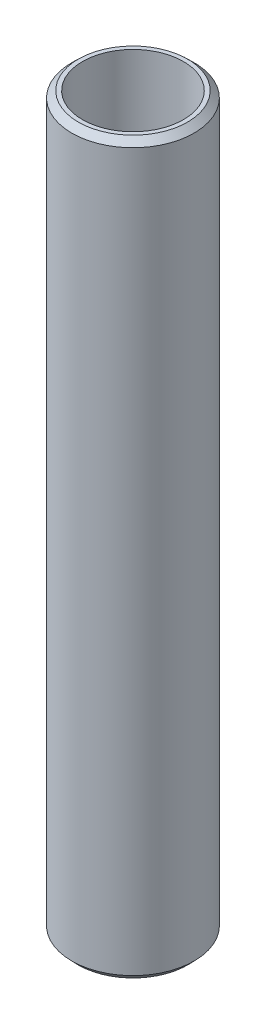
ISO-10303-21;
HEADER;
FILE_DESCRIPTION(('STEP AP214'),'2;1');
FILE_NAME('part.step','',(''),(''),'','','');
FILE_SCHEMA(('AUTOMOTIVE_DESIGN { 1 0 10303 214 1 1 1 1 }'));
ENDSEC;
DATA;
#1=APPLICATION_CONTEXT('core data for automotive mechanical design processes');
#2=APPLICATION_PROTOCOL_DEFINITION('international standard','automotive_design',2000,#1);
#3=PRODUCT_CONTEXT('',#1,'mechanical');
#4=PRODUCT('Part','Part','',(#3));
#5=PRODUCT_RELATED_PRODUCT_CATEGORY('part','',(#4));
#6=PRODUCT_DEFINITION_FORMATION('','',#4);
#7=PRODUCT_DEFINITION_CONTEXT('part definition',#1,'design');
#8=PRODUCT_DEFINITION('design','',#6,#7);
#9=PRODUCT_DEFINITION_SHAPE('','',#8);
#10=(LENGTH_UNIT() NAMED_UNIT(*) SI_UNIT(.MILLI.,.METRE.));
#11=(NAMED_UNIT(*) PLANE_ANGLE_UNIT() SI_UNIT($,.RADIAN.));
#12=(NAMED_UNIT(*) SI_UNIT($,.STERADIAN.) SOLID_ANGLE_UNIT());
#13=UNCERTAINTY_MEASURE_WITH_UNIT(LENGTH_MEASURE(1.E-05),#10,'distance_accuracy_value','');
#14=(GEOMETRIC_REPRESENTATION_CONTEXT(3) GLOBAL_UNCERTAINTY_ASSIGNED_CONTEXT((#13)) GLOBAL_UNIT_ASSIGNED_CONTEXT((#10,
#11,#12)) REPRESENTATION_CONTEXT('',''));
#15=CARTESIAN_POINT('',(0.,0.,0.));
#16=DIRECTION('',(0.,0.,1.));
#17=DIRECTION('',(1.,0.,0.));
#18=AXIS2_PLACEMENT_3D('',#15,#16,#17);
#19=CARTESIAN_POINT('',(0.,358.177548737771,0.));
#20=DIRECTION('',(0.,-1.,0.));
#21=DIRECTION('',(0.,0.,-1.));
#22=AXIS2_PLACEMENT_3D('',#19,#20,#21);
#23=CYLINDRICAL_SURFACE('',#22,30.);
#24=CARTESIAN_POINT('',(0.,355.091913061308,0.));
#25=DIRECTION('',(0.,1.,0.));
#26=DIRECTION('',(0.,0.,1.));
#27=AXIS2_PLACEMENT_3D('',#24,#25,#26);
#28=CIRCLE('',#27,30.);
#29=CARTESIAN_POINT('',(0.,355.091913061308,30.));
#30=VERTEX_POINT('',#29);
#31=EDGE_CURVE('E50',#30,#30,#28,.F.);
#32=ORIENTED_EDGE('',*,*,#31,.T.);
#33=EDGE_LOOP('',(#32));
#34=FACE_BOUND('',#33,.T.);
#35=CARTESIAN_POINT('',(0.,3.19123104294827,0.));
#36=DIRECTION('',(0.,1.,0.));
#37=DIRECTION('',(0.,0.,1.));
#38=AXIS2_PLACEMENT_3D('',#35,#36,#37);
#39=CIRCLE('',#38,30.);
#40=CARTESIAN_POINT('',(0.,3.19123104294827,30.));
#41=VERTEX_POINT('',#40);
#42=EDGE_CURVE('E51',#41,#41,#39,.T.);
#43=ORIENTED_EDGE('',*,*,#42,.T.);
#44=EDGE_LOOP('',(#43));
#45=FACE_BOUND('',#44,.T.);
#46=ADVANCED_FACE('F39',(#34,#45),#23,.T.);
#47=CARTESIAN_POINT('',(0.,358.177548737771,0.));
#48=DIRECTION('',(0.,1.,0.));
#49=DIRECTION('',(0.,0.,1.));
#50=AXIS2_PLACEMENT_3D('',#47,#48,#49);
#51=PLANE('',#50);
#52=CARTESIAN_POINT('',(0.,358.177548737771,0.));
#53=DIRECTION('',(0.,1.,0.));
#54=DIRECTION('',(0.,0.,1.));
#55=AXIS2_PLACEMENT_3D('',#52,#53,#54);
#56=CIRCLE('',#55,26.8087689570517);
#57=CARTESIAN_POINT('',(0.,358.177548737771,26.8087689570517));
#58=VERTEX_POINT('',#57);
#59=EDGE_CURVE('E54',#58,#58,#56,.T.);
#60=ORIENTED_EDGE('',*,*,#59,.T.);
#61=EDGE_LOOP('',(#60));
#62=FACE_BOUND('',#61,.T.);
#63=CARTESIAN_POINT('',(0.,358.177548737771,0.));
#64=DIRECTION('',(0.,1.,0.));
#65=DIRECTION('',(0.,0.,1.));
#66=AXIS2_PLACEMENT_3D('',#63,#64,#65);
#67=CIRCLE('',#66,24.7585562164972);
#68=CARTESIAN_POINT('',(0.,358.177548737771,24.7585562164972));
#69=VERTEX_POINT('',#68);
#70=EDGE_CURVE('E58',#69,#69,#67,.T.);
#71=ORIENTED_EDGE('',*,*,#70,.F.);
#72=EDGE_LOOP('',(#71));
#73=FACE_BOUND('',#72,.T.);
#74=ADVANCED_FACE('F69',(#62,#73),#51,.T.);
#75=CARTESIAN_POINT('',(0.,0.,0.));
#76=DIRECTION('',(0.,1.,0.));
#77=DIRECTION('',(0.,0.,1.));
#78=AXIS2_PLACEMENT_3D('',#75,#76,#77);
#79=PLANE('',#78);
#80=CARTESIAN_POINT('',(0.,0.,0.));
#81=DIRECTION('',(0.,1.,0.));
#82=DIRECTION('',(0.,0.,1.));
#83=AXIS2_PLACEMENT_3D('',#80,#81,#82);
#84=CIRCLE('',#83,26.914364323537);
#85=CARTESIAN_POINT('',(0.,0.,26.914364323537));
#86=VERTEX_POINT('',#85);
#87=EDGE_CURVE('E10',#86,#86,#84,.F.);
#88=ORIENTED_EDGE('',*,*,#87,.T.);
#89=EDGE_LOOP('',(#88));
#90=FACE_BOUND('',#89,.T.);
#91=CARTESIAN_POINT('',(0.,0.,0.));
#92=DIRECTION('',(0.,1.,0.));
#93=DIRECTION('',(0.,0.,1.));
#94=AXIS2_PLACEMENT_3D('',#91,#92,#93);
#95=CIRCLE('',#94,24.7585562164972);
#96=CARTESIAN_POINT('',(0.,0.,24.7585562164972));
#97=VERTEX_POINT('',#96);
#98=EDGE_CURVE('E63',#97,#97,#95,.T.);
#99=ORIENTED_EDGE('',*,*,#98,.T.);
#100=EDGE_LOOP('',(#99));
#101=FACE_BOUND('',#100,.T.);
#102=ADVANCED_FACE('F75',(#90,#101),#79,.F.);
#103=CARTESIAN_POINT('',(0.,358.177548737771,0.));
#104=DIRECTION('',(0.,-1.,0.));
#105=DIRECTION('',(0.,0.,-1.));
#106=AXIS2_PLACEMENT_3D('',#103,#104,#105);
#107=CYLINDRICAL_SURFACE('',#106,24.7585562164972);
#108=ORIENTED_EDGE('',*,*,#70,.T.);
#109=EDGE_LOOP('',(#108));
#110=FACE_BOUND('',#109,.T.);
#111=ORIENTED_EDGE('',*,*,#98,.F.);
#112=EDGE_LOOP('',(#111));
#113=FACE_BOUND('',#112,.T.);
#114=ADVANCED_FACE('F70',(#110,#113),#107,.F.);
#115=CARTESIAN_POINT('',(0.,358.177548737771,0.));
#116=DIRECTION('',(0.,-1.,0.));
#117=DIRECTION('',(0.,0.,-1.));
#118=AXIS2_PLACEMENT_3D('',#115,#116,#117);
#119=CONICAL_SURFACE('',#118,26.8087689570517,0.80221951891329);
#120=ORIENTED_EDGE('',*,*,#31,.F.);
#121=EDGE_LOOP('',(#120));
#122=FACE_BOUND('',#121,.T.);
#123=ORIENTED_EDGE('',*,*,#59,.F.);
#124=EDGE_LOOP('',(#123));
#125=FACE_BOUND('',#124,.T.);
#126=ADVANCED_FACE('F81',(#122,#125),#119,.T.);
#127=CARTESIAN_POINT('',(0.,3.19123104294827,0.));
#128=DIRECTION('',(0.,1.,0.));
#129=DIRECTION('',(0.,0.,1.));
#130=AXIS2_PLACEMENT_3D('',#127,#128,#129);
#131=CONICAL_SURFACE('',#130,30.,0.768576807881607);
#132=ORIENTED_EDGE('',*,*,#87,.F.);
#133=EDGE_LOOP('',(#132));
#134=FACE_BOUND('',#133,.T.);
#135=ORIENTED_EDGE('',*,*,#42,.F.);
#136=EDGE_LOOP('',(#135));
#137=FACE_BOUND('',#136,.T.);
#138=ADVANCED_FACE('F45',(#134,#137),#131,.T.);
#139=CLOSED_SHELL('',(#46,#74,#102,#114,#126,#138));
#140=MANIFOLD_SOLID_BREP('B2',#139);
#141=ADVANCED_BREP_SHAPE_REPRESENTATION('',(#18,#140),#14);
#142=SHAPE_DEFINITION_REPRESENTATION(#9,#141);
ENDSEC;
END-ISO-10303-21;
